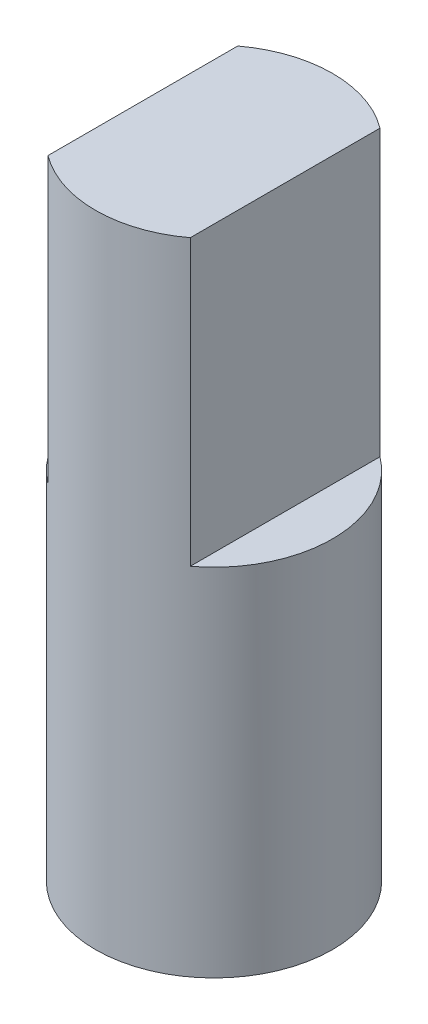
ISO-10303-21;
HEADER;
FILE_DESCRIPTION(('STEP AP214'),'2;1');
FILE_NAME('part.step','',(''),(''),'','','');
FILE_SCHEMA(('AUTOMOTIVE_DESIGN { 1 0 10303 214 1 1 1 1 }'));
ENDSEC;
DATA;
#1=APPLICATION_CONTEXT('core data for automotive mechanical design processes');
#2=APPLICATION_PROTOCOL_DEFINITION('international standard','automotive_design',2000,#1);
#3=PRODUCT_CONTEXT('',#1,'mechanical');
#4=PRODUCT('Part','Part','',(#3));
#5=PRODUCT_RELATED_PRODUCT_CATEGORY('part','',(#4));
#6=PRODUCT_DEFINITION_FORMATION('','',#4);
#7=PRODUCT_DEFINITION_CONTEXT('part definition',#1,'design');
#8=PRODUCT_DEFINITION('design','',#6,#7);
#9=PRODUCT_DEFINITION_SHAPE('','',#8);
#10=(LENGTH_UNIT() NAMED_UNIT(*) SI_UNIT(.MILLI.,.METRE.));
#11=(NAMED_UNIT(*) PLANE_ANGLE_UNIT() SI_UNIT($,.RADIAN.));
#12=(NAMED_UNIT(*) SI_UNIT($,.STERADIAN.) SOLID_ANGLE_UNIT());
#13=UNCERTAINTY_MEASURE_WITH_UNIT(LENGTH_MEASURE(1.E-05),#10,'distance_accuracy_value','');
#14=(GEOMETRIC_REPRESENTATION_CONTEXT(3) GLOBAL_UNCERTAINTY_ASSIGNED_CONTEXT((#13)) GLOBAL_UNIT_ASSIGNED_CONTEXT((#10,
#11,#12)) REPRESENTATION_CONTEXT('',''));
#15=CARTESIAN_POINT('',(0.,0.,0.));
#16=DIRECTION('',(0.,0.,1.));
#17=DIRECTION('',(1.,0.,0.));
#18=AXIS2_PLACEMENT_3D('',#15,#16,#17);
#19=CARTESIAN_POINT('',(-8.,23.,0.));
#20=DIRECTION('',(0.,1.,0.));
#21=DIRECTION('',(0.,0.,1.));
#22=AXIS2_PLACEMENT_3D('',#19,#20,#21);
#23=PLANE('',#22);
#24=CARTESIAN_POINT('',(-8.,23.,0.));
#25=DIRECTION('',(0.,1.,0.));
#26=DIRECTION('',(0.,0.,1.));
#27=AXIS2_PLACEMENT_3D('',#24,#25,#26);
#28=CIRCLE('',#27,2.5);
#29=CARTESIAN_POINT('',(-9.5,23.,-2.));
#30=VERTEX_POINT('',#29);
#31=CARTESIAN_POINT('',(-9.5,23.,2.));
#32=VERTEX_POINT('',#31);
#33=EDGE_CURVE('E74',#30,#32,#28,.T.);
#34=ORIENTED_EDGE('',*,*,#33,.T.);
#35=DIRECTION('',(0.,0.,-1.));
#36=VECTOR('',#35,1.);
#37=CARTESIAN_POINT('',(-9.5,23.,0.));
#38=LINE('',#37,#36);
#39=EDGE_CURVE('E83',#32,#30,#38,.T.);
#40=ORIENTED_EDGE('',*,*,#39,.T.);
#41=EDGE_LOOP('',(#34,#40));
#42=FACE_BOUND('',#41,.T.);
#43=ADVANCED_FACE('F65',(#42),#23,.T.);
#44=CARTESIAN_POINT('',(-8.,23.,0.));
#45=DIRECTION('',(0.,-1.,0.));
#46=DIRECTION('',(0.,0.,-1.));
#47=AXIS2_PLACEMENT_3D('',#44,#45,#46);
#48=CYLINDRICAL_SURFACE('',#47,2.5);
#49=CARTESIAN_POINT('',(-6.5,23.,2.));
#50=VERTEX_POINT('',#49);
#51=CARTESIAN_POINT('',(-6.5,23.,-2.));
#52=VERTEX_POINT('',#51);
#53=EDGE_CURVE('E12',#50,#52,#28,.T.);
#54=ORIENTED_EDGE('',*,*,#53,.F.);
#55=DIRECTION('',(0.,-1.,0.));
#56=VECTOR('',#55,1.);
#57=CARTESIAN_POINT('',(-6.5,29.,2.));
#58=LINE('',#57,#56);
#59=CARTESIAN_POINT('',(-6.5,29.,2.));
#60=VERTEX_POINT('',#59);
#61=EDGE_CURVE('E108',#60,#50,#58,.T.);
#62=ORIENTED_EDGE('',*,*,#61,.F.);
#63=CARTESIAN_POINT('',(-8.,29.,0.));
#64=DIRECTION('',(0.,1.,0.));
#65=DIRECTION('',(0.,0.,1.));
#66=AXIS2_PLACEMENT_3D('',#63,#64,#65);
#67=CIRCLE('',#66,2.5);
#68=CARTESIAN_POINT('',(-9.5,29.,2.));
#69=VERTEX_POINT('',#68);
#70=EDGE_CURVE('E115',#69,#60,#67,.T.);
#71=ORIENTED_EDGE('',*,*,#70,.F.);
#72=DIRECTION('',(0.,-1.,0.));
#73=VECTOR('',#72,1.);
#74=CARTESIAN_POINT('',(-9.5,29.,2.));
#75=LINE('',#74,#73);
#76=EDGE_CURVE('E136',#69,#32,#75,.T.);
#77=ORIENTED_EDGE('',*,*,#76,.T.);
#78=ORIENTED_EDGE('',*,*,#33,.F.);
#79=DIRECTION('',(0.,-1.,0.));
#80=VECTOR('',#79,1.);
#81=CARTESIAN_POINT('',(-9.5,29.,-2.));
#82=LINE('',#81,#80);
#83=CARTESIAN_POINT('',(-9.5,29.,-2.));
#84=VERTEX_POINT('',#83);
#85=EDGE_CURVE('E130',#84,#30,#82,.T.);
#86=ORIENTED_EDGE('',*,*,#85,.F.);
#87=CARTESIAN_POINT('',(-6.5,29.,-2.));
#88=VERTEX_POINT('',#87);
#89=EDGE_CURVE('E114',#88,#84,#67,.T.);
#90=ORIENTED_EDGE('',*,*,#89,.F.);
#91=DIRECTION('',(0.,-1.,0.));
#92=VECTOR('',#91,1.);
#93=CARTESIAN_POINT('',(-6.5,29.,-2.));
#94=LINE('',#93,#92);
#95=EDGE_CURVE('E110',#88,#52,#94,.T.);
#96=ORIENTED_EDGE('',*,*,#95,.T.);
#97=EDGE_LOOP('',(#54,#62,#71,#77,#78,#86,#90,#96));
#98=FACE_BOUND('',#97,.T.);
#99=CARTESIAN_POINT('',(-8.,15.5,0.));
#100=DIRECTION('',(0.,-1.,0.));
#101=DIRECTION('',(0.,0.,-1.));
#102=AXIS2_PLACEMENT_3D('',#99,#100,#101);
#103=CIRCLE('',#102,2.5);
#104=CARTESIAN_POINT('',(-8.,15.5,-2.5));
#105=VERTEX_POINT('',#104);
#106=EDGE_CURVE('E144',#105,#105,#103,.T.);
#107=ORIENTED_EDGE('',*,*,#106,.F.);
#108=EDGE_LOOP('',(#107));
#109=FACE_BOUND('',#108,.T.);
#110=ADVANCED_FACE('F67',(#98,#109),#48,.T.);
#111=DIRECTION('',(0.,0.,-1.));
#112=VECTOR('',#111,1.);
#113=CARTESIAN_POINT('',(-6.5,23.,0.));
#114=LINE('',#113,#112);
#115=EDGE_CURVE('E141',#50,#52,#114,.T.);
#116=ORIENTED_EDGE('',*,*,#115,.F.);
#117=ORIENTED_EDGE('',*,*,#53,.T.);
#118=EDGE_LOOP('',(#116,#117));
#119=FACE_BOUND('',#118,.T.);
#120=ADVANCED_FACE('F153',(#119),#23,.T.);
#121=CARTESIAN_POINT('',(-6.5,29.,0.));
#122=DIRECTION('',(-1.,0.,0.));
#123=DIRECTION('',(0.,0.,1.));
#124=AXIS2_PLACEMENT_3D('',#121,#122,#123);
#125=PLANE('',#124);
#126=ORIENTED_EDGE('',*,*,#115,.T.);
#127=ORIENTED_EDGE('',*,*,#95,.F.);
#128=DIRECTION('',(0.,0.,-1.));
#129=VECTOR('',#128,1.);
#130=CARTESIAN_POINT('',(-6.5,29.,0.));
#131=LINE('',#130,#129);
#132=EDGE_CURVE('E103',#60,#88,#131,.T.);
#133=ORIENTED_EDGE('',*,*,#132,.F.);
#134=ORIENTED_EDGE('',*,*,#61,.T.);
#135=EDGE_LOOP('',(#126,#127,#133,#134));
#136=FACE_BOUND('',#135,.T.);
#137=ADVANCED_FACE('F106',(#136),#125,.F.);
#138=CARTESIAN_POINT('',(-9.5,29.,0.));
#139=DIRECTION('',(-1.,0.,0.));
#140=DIRECTION('',(0.,0.,1.));
#141=AXIS2_PLACEMENT_3D('',#138,#139,#140);
#142=PLANE('',#141);
#143=ORIENTED_EDGE('',*,*,#39,.F.);
#144=ORIENTED_EDGE('',*,*,#76,.F.);
#145=DIRECTION('',(0.,0.,-1.));
#146=VECTOR('',#145,1.);
#147=CARTESIAN_POINT('',(-9.5,29.,0.));
#148=LINE('',#147,#146);
#149=EDGE_CURVE('E121',#69,#84,#148,.T.);
#150=ORIENTED_EDGE('',*,*,#149,.T.);
#151=ORIENTED_EDGE('',*,*,#85,.T.);
#152=EDGE_LOOP('',(#143,#144,#150,#151));
#153=FACE_BOUND('',#152,.T.);
#154=ADVANCED_FACE('F164',(#153),#142,.T.);
#155=CARTESIAN_POINT('',(0.,29.,0.));
#156=DIRECTION('',(0.,1.,0.));
#157=DIRECTION('',(0.,0.,1.));
#158=AXIS2_PLACEMENT_3D('',#155,#156,#157);
#159=PLANE('',#158);
#160=ORIENTED_EDGE('',*,*,#70,.T.);
#161=ORIENTED_EDGE('',*,*,#132,.T.);
#162=ORIENTED_EDGE('',*,*,#89,.T.);
#163=ORIENTED_EDGE('',*,*,#149,.F.);
#164=EDGE_LOOP('',(#160,#161,#162,#163));
#165=FACE_BOUND('',#164,.T.);
#166=ADVANCED_FACE('F119',(#165),#159,.T.);
#167=CARTESIAN_POINT('',(-8.,15.5,0.));
#168=DIRECTION('',(0.,-1.,0.));
#169=DIRECTION('',(0.,0.,-1.));
#170=AXIS2_PLACEMENT_3D('',#167,#168,#169);
#171=PLANE('',#170);
#172=ORIENTED_EDGE('',*,*,#106,.T.);
#173=EDGE_LOOP('',(#172));
#174=FACE_BOUND('',#173,.T.);
#175=ADVANCED_FACE('F151',(#174),#171,.T.);
#176=CLOSED_SHELL('',(#43,#110,#120,#137,#154,#166,#175));
#177=MANIFOLD_SOLID_BREP('B2',#176);
#178=ADVANCED_BREP_SHAPE_REPRESENTATION('',(#18,#177),#14);
#179=SHAPE_DEFINITION_REPRESENTATION(#9,#178);
ENDSEC;
END-ISO-10303-21;
